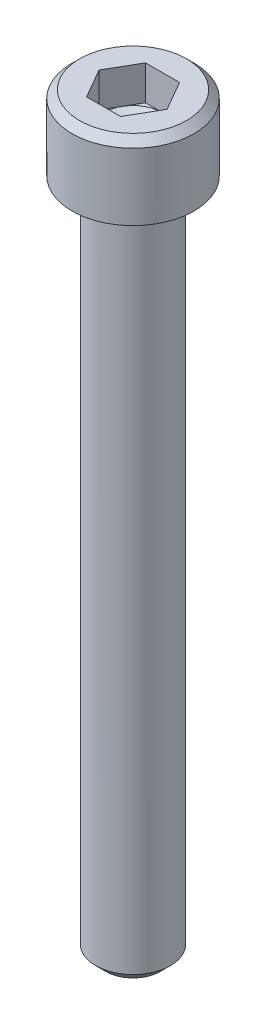
ISO-10303-21;
HEADER;
FILE_DESCRIPTION(('STEP AP214'),'2;1');
FILE_NAME('part.step','',(''),(''),'','','');
FILE_SCHEMA(('AUTOMOTIVE_DESIGN { 1 0 10303 214 1 1 1 1 }'));
ENDSEC;
DATA;
#1=APPLICATION_CONTEXT('core data for automotive mechanical design processes');
#2=APPLICATION_PROTOCOL_DEFINITION('international standard','automotive_design',2000,#1);
#3=PRODUCT_CONTEXT('',#1,'mechanical');
#4=PRODUCT('Part','Part','',(#3));
#5=PRODUCT_RELATED_PRODUCT_CATEGORY('part','',(#4));
#6=PRODUCT_DEFINITION_FORMATION('','',#4);
#7=PRODUCT_DEFINITION_CONTEXT('part definition',#1,'design');
#8=PRODUCT_DEFINITION('design','',#6,#7);
#9=PRODUCT_DEFINITION_SHAPE('','',#8);
#10=(LENGTH_UNIT() NAMED_UNIT(*) SI_UNIT(.MILLI.,.METRE.));
#11=(NAMED_UNIT(*) PLANE_ANGLE_UNIT() SI_UNIT($,.RADIAN.));
#12=(NAMED_UNIT(*) SI_UNIT($,.STERADIAN.) SOLID_ANGLE_UNIT());
#13=UNCERTAINTY_MEASURE_WITH_UNIT(LENGTH_MEASURE(1.E-05),#10,'distance_accuracy_value','');
#14=(GEOMETRIC_REPRESENTATION_CONTEXT(3) GLOBAL_UNCERTAINTY_ASSIGNED_CONTEXT((#13)) GLOBAL_UNIT_ASSIGNED_CONTEXT((#10,
#11,#12)) REPRESENTATION_CONTEXT('',''));
#15=CARTESIAN_POINT('',(0.,0.,0.));
#16=DIRECTION('',(0.,0.,1.));
#17=DIRECTION('',(1.,0.,0.));
#18=AXIS2_PLACEMENT_3D('',#15,#16,#17);
#19=CARTESIAN_POINT('',(0.,1.87959999988152,0.));
#20=DIRECTION('',(0.,1.,0.));
#21=DIRECTION('',(0.,0.,1.));
#22=AXIS2_PLACEMENT_3D('',#19,#20,#21);
#23=CONICAL_SURFACE('',#22,1.38429999981327,1.04719755105418);
#24=CARTESIAN_POINT('',(0.,1.08037402230821,-1.70530256582424E-10));
#25=VERTEX_POINT('',#24);
#26=VERTEX_LOOP('',#25);
#27=FACE_BOUND('',#26,.T.);
#28=CARTESIAN_POINT('',(0.,1.87959999997998,0.));
#29=DIRECTION('',(0.,1.,0.));
#30=DIRECTION('',(0.,0.,1.));
#31=AXIS2_PLACEMENT_3D('',#28,#29,#30);
#32=CIRCLE('',#31,1.3842999999838);
#33=CARTESIAN_POINT('',(-1.19883896645178,1.87959999998999,-0.692149999995953));
#34=VERTEX_POINT('',#33);
#35=CARTESIAN_POINT('',(0.,1.87959999998999,-1.3842999999919));
#36=VERTEX_POINT('',#35);
#37=EDGE_CURVE('E150',#34,#36,#32,.F.);
#38=ORIENTED_EDGE('',*,*,#37,.F.);
#39=CARTESIAN_POINT('',(0.,1.87959999997998,0.));
#40=DIRECTION('',(0.,1.,0.));
#41=DIRECTION('',(0.,0.,1.));
#42=AXIS2_PLACEMENT_3D('',#39,#40,#41);
#43=CIRCLE('',#42,1.3842999999838);
#44=CARTESIAN_POINT('',(-1.19883896645178,1.87959999998999,0.692149999995946));
#45=VERTEX_POINT('',#44);
#46=EDGE_CURVE('E97',#45,#34,#43,.F.);
#47=ORIENTED_EDGE('',*,*,#46,.F.);
#48=CARTESIAN_POINT('',(0.,1.87959999997998,0.));
#49=DIRECTION('',(0.,1.,0.));
#50=DIRECTION('',(0.,0.,1.));
#51=AXIS2_PLACEMENT_3D('',#48,#49,#50);
#52=CIRCLE('',#51,1.3842999999838);
#53=CARTESIAN_POINT('',(0.,1.87959999998999,1.3842999999919));
#54=VERTEX_POINT('',#53);
#55=EDGE_CURVE('E93',#54,#45,#52,.F.);
#56=ORIENTED_EDGE('',*,*,#55,.F.);
#57=CARTESIAN_POINT('',(0.,1.87959999997998,0.));
#58=DIRECTION('',(0.,1.,0.));
#59=DIRECTION('',(0.,0.,1.));
#60=AXIS2_PLACEMENT_3D('',#57,#58,#59);
#61=CIRCLE('',#60,1.3842999999838);
#62=CARTESIAN_POINT('',(1.19883896645178,1.87959999998999,0.692149999995948));
#63=VERTEX_POINT('',#62);
#64=EDGE_CURVE('E91',#63,#54,#61,.F.);
#65=ORIENTED_EDGE('',*,*,#64,.F.);
#66=CARTESIAN_POINT('',(0.,1.87959999997998,0.));
#67=DIRECTION('',(0.,1.,0.));
#68=DIRECTION('',(0.,0.,1.));
#69=AXIS2_PLACEMENT_3D('',#66,#67,#68);
#70=CIRCLE('',#69,1.3842999999838);
#71=CARTESIAN_POINT('',(1.19883896645178,1.87959999998999,-0.692149999995947));
#72=VERTEX_POINT('',#71);
#73=EDGE_CURVE('E21',#72,#63,#70,.F.);
#74=ORIENTED_EDGE('',*,*,#73,.F.);
#75=CARTESIAN_POINT('',(0.,1.87959999997998,0.));
#76=DIRECTION('',(0.,1.,0.));
#77=DIRECTION('',(0.,0.,1.));
#78=AXIS2_PLACEMENT_3D('',#75,#76,#77);
#79=CIRCLE('',#78,1.3842999999838);
#80=EDGE_CURVE('E108',#36,#72,#79,.F.);
#81=ORIENTED_EDGE('',*,*,#80,.F.);
#82=EDGE_LOOP('',(#38,#47,#56,#65,#74,#81));
#83=FACE_BOUND('',#82,.T.);
#84=ADVANCED_FACE('F18',(#27,#83),#23,.F.);
#85=CARTESIAN_POINT('',(0.,1.8796,0.));
#86=DIRECTION('',(0.,1.,0.));
#87=DIRECTION('',(0.,0.,1.));
#88=AXIS2_PLACEMENT_3D('',#85,#86,#87);
#89=PLANE('',#88);
#90=DIRECTION('',(0.500000000000001,0.,-0.866025403784438));
#91=VECTOR('',#90,1.);
#92=CARTESIAN_POINT('',(0.799225977639198,1.8796,1.3843));
#93=LINE('',#92,#91);
#94=CARTESIAN_POINT('',(1.5984519552784,1.8796,0.));
#95=VERTEX_POINT('',#94);
#96=EDGE_CURVE('E103',#63,#95,#93,.T.);
#97=ORIENTED_EDGE('',*,*,#96,.T.);
#98=DIRECTION('',(-0.499999999999999,0.,-0.866025403784439));
#99=VECTOR('',#98,1.);
#100=CARTESIAN_POINT('',(1.5984519552784,1.8796,0.));
#101=LINE('',#100,#99);
#102=EDGE_CURVE('E106',#95,#72,#101,.T.);
#103=ORIENTED_EDGE('',*,*,#102,.T.);
#104=ORIENTED_EDGE('',*,*,#73,.T.);
#105=EDGE_LOOP('',(#97,#103,#104));
#106=FACE_BOUND('',#105,.T.);
#107=ADVANCED_FACE('F101',(#106),#89,.T.);
#108=CARTESIAN_POINT('',(0.,1.8796,0.));
#109=DIRECTION('',(0.,1.,0.));
#110=DIRECTION('',(0.,0.,1.));
#111=AXIS2_PLACEMENT_3D('',#108,#109,#110);
#112=PLANE('',#111);
#113=DIRECTION('',(-0.499999999999999,0.,-0.866025403784439));
#114=VECTOR('',#113,1.);
#115=CARTESIAN_POINT('',(1.5984519552784,1.8796,0.));
#116=LINE('',#115,#114);
#117=CARTESIAN_POINT('',(0.799225977639201,1.8796,-1.3843));
#118=VERTEX_POINT('',#117);
#119=EDGE_CURVE('E117',#72,#118,#116,.T.);
#120=ORIENTED_EDGE('',*,*,#119,.T.);
#121=DIRECTION('',(-1.,0.,0.));
#122=VECTOR('',#121,1.);
#123=CARTESIAN_POINT('',(0.799225977639201,1.8796,-1.3843));
#124=LINE('',#123,#122);
#125=EDGE_CURVE('E157',#118,#36,#124,.T.);
#126=ORIENTED_EDGE('',*,*,#125,.T.);
#127=ORIENTED_EDGE('',*,*,#80,.T.);
#128=EDGE_LOOP('',(#120,#126,#127));
#129=FACE_BOUND('',#128,.T.);
#130=ADVANCED_FACE('F154',(#129),#112,.T.);
#131=CARTESIAN_POINT('',(0.,1.8796,0.));
#132=DIRECTION('',(0.,1.,0.));
#133=DIRECTION('',(0.,0.,1.));
#134=AXIS2_PLACEMENT_3D('',#131,#132,#133);
#135=PLANE('',#134);
#136=DIRECTION('',(-1.,0.,0.));
#137=VECTOR('',#136,1.);
#138=CARTESIAN_POINT('',(0.799225977639201,1.8796,-1.3843));
#139=LINE('',#138,#137);
#140=CARTESIAN_POINT('',(-0.799225977639195,1.8796,-1.3843));
#141=VERTEX_POINT('',#140);
#142=EDGE_CURVE('E162',#36,#141,#139,.T.);
#143=ORIENTED_EDGE('',*,*,#142,.T.);
#144=DIRECTION('',(-0.5,0.,0.866025403784438));
#145=VECTOR('',#144,1.);
#146=CARTESIAN_POINT('',(-0.799225977639195,1.8796,-1.3843));
#147=LINE('',#146,#145);
#148=EDGE_CURVE('E165',#141,#34,#147,.T.);
#149=ORIENTED_EDGE('',*,*,#148,.T.);
#150=ORIENTED_EDGE('',*,*,#37,.T.);
#151=EDGE_LOOP('',(#143,#149,#150));
#152=FACE_BOUND('',#151,.T.);
#153=ADVANCED_FACE('F161',(#152),#135,.T.);
#154=CARTESIAN_POINT('',(0.,1.8796,0.));
#155=DIRECTION('',(0.,1.,0.));
#156=DIRECTION('',(0.,0.,1.));
#157=AXIS2_PLACEMENT_3D('',#154,#155,#156);
#158=PLANE('',#157);
#159=DIRECTION('',(-0.5,0.,0.866025403784438));
#160=VECTOR('',#159,1.);
#161=CARTESIAN_POINT('',(-0.799225977639195,1.8796,-1.3843));
#162=LINE('',#161,#160);
#163=CARTESIAN_POINT('',(-1.5984519552784,1.8796,0.));
#164=VERTEX_POINT('',#163);
#165=EDGE_CURVE('E173',#34,#164,#162,.T.);
#166=ORIENTED_EDGE('',*,*,#165,.T.);
#167=DIRECTION('',(0.5,0.,0.866025403784439));
#168=VECTOR('',#167,1.);
#169=CARTESIAN_POINT('',(-1.5984519552784,1.8796,0.));
#170=LINE('',#169,#168);
#171=EDGE_CURVE('E232',#164,#45,#170,.T.);
#172=ORIENTED_EDGE('',*,*,#171,.T.);
#173=ORIENTED_EDGE('',*,*,#46,.T.);
#174=EDGE_LOOP('',(#166,#172,#173));
#175=FACE_BOUND('',#174,.T.);
#176=ADVANCED_FACE('F337',(#175),#158,.T.);
#177=CARTESIAN_POINT('',(0.,1.8796,0.));
#178=DIRECTION('',(0.,1.,0.));
#179=DIRECTION('',(0.,0.,1.));
#180=AXIS2_PLACEMENT_3D('',#177,#178,#179);
#181=PLANE('',#180);
#182=DIRECTION('',(1.,0.,0.));
#183=VECTOR('',#182,1.);
#184=CARTESIAN_POINT('',(-0.799225977639198,1.8796,1.3843));
#185=LINE('',#184,#183);
#186=CARTESIAN_POINT('',(0.799225977639198,1.8796,1.3843));
#187=VERTEX_POINT('',#186);
#188=EDGE_CURVE('E113',#54,#187,#185,.T.);
#189=ORIENTED_EDGE('',*,*,#188,.T.);
#190=DIRECTION('',(0.500000000000001,0.,-0.866025403784438));
#191=VECTOR('',#190,1.);
#192=CARTESIAN_POINT('',(0.799225977639198,1.8796,1.3843));
#193=LINE('',#192,#191);
#194=EDGE_CURVE('E110',#187,#63,#193,.T.);
#195=ORIENTED_EDGE('',*,*,#194,.T.);
#196=ORIENTED_EDGE('',*,*,#64,.T.);
#197=EDGE_LOOP('',(#189,#195,#196));
#198=FACE_BOUND('',#197,.T.);
#199=ADVANCED_FACE('F111',(#198),#181,.T.);
#200=CARTESIAN_POINT('',(0.,1.8796,0.));
#201=DIRECTION('',(0.,1.,0.));
#202=DIRECTION('',(0.,0.,1.));
#203=AXIS2_PLACEMENT_3D('',#200,#201,#202);
#204=PLANE('',#203);
#205=DIRECTION('',(0.5,0.,0.866025403784439));
#206=VECTOR('',#205,1.);
#207=CARTESIAN_POINT('',(-1.5984519552784,1.8796,0.));
#208=LINE('',#207,#206);
#209=CARTESIAN_POINT('',(-0.799225977639199,1.8796,1.3843));
#210=VERTEX_POINT('',#209);
#211=EDGE_CURVE('E169',#45,#210,#208,.T.);
#212=ORIENTED_EDGE('',*,*,#211,.T.);
#213=DIRECTION('',(1.,0.,0.));
#214=VECTOR('',#213,1.);
#215=CARTESIAN_POINT('',(-0.799225977639198,1.8796,1.3843));
#216=LINE('',#215,#214);
#217=EDGE_CURVE('E133',#210,#54,#216,.T.);
#218=ORIENTED_EDGE('',*,*,#217,.T.);
#219=ORIENTED_EDGE('',*,*,#55,.T.);
#220=EDGE_LOOP('',(#212,#218,#219));
#221=FACE_BOUND('',#220,.T.);
#222=ADVANCED_FACE('F331',(#221),#204,.T.);
#223=CARTESIAN_POINT('',(0.799225977639198,3.5052,1.3843));
#224=DIRECTION('',(0.866025403784438,0.,0.500000000000001));
#225=DIRECTION('',(0.500000000000001,0.,-0.866025403784438));
#226=AXIS2_PLACEMENT_3D('',#223,#224,#225);
#227=PLANE('',#226);
#228=DIRECTION('',(0.,1.,0.));
#229=VECTOR('',#228,1.);
#230=CARTESIAN_POINT('',(0.799225977639198,3.5052,1.3843));
#231=LINE('',#230,#229);
#232=CARTESIAN_POINT('',(0.799225977639198,3.5052,1.3843));
#233=VERTEX_POINT('',#232);
#234=EDGE_CURVE('E240',#187,#233,#231,.T.);
#235=ORIENTED_EDGE('',*,*,#234,.T.);
#236=DIRECTION('',(0.500000000000002,0.,-0.866025403784437));
#237=VECTOR('',#236,1.);
#238=CARTESIAN_POINT('',(0.799225977639198,3.5052,1.3843));
#239=LINE('',#238,#237);
#240=CARTESIAN_POINT('',(1.5984519552784,3.5052,0.));
#241=VERTEX_POINT('',#240);
#242=EDGE_CURVE('E130',#233,#241,#239,.T.);
#243=ORIENTED_EDGE('',*,*,#242,.T.);
#244=DIRECTION('',(0.,1.,0.));
#245=VECTOR('',#244,1.);
#246=CARTESIAN_POINT('',(1.5984519552784,3.5052,0.));
#247=LINE('',#246,#245);
#248=EDGE_CURVE('E121',#241,#95,#247,.F.);
#249=ORIENTED_EDGE('',*,*,#248,.T.);
#250=ORIENTED_EDGE('',*,*,#96,.F.);
#251=ORIENTED_EDGE('',*,*,#194,.F.);
#252=EDGE_LOOP('',(#235,#243,#249,#250,#251));
#253=FACE_BOUND('',#252,.T.);
#254=ADVANCED_FACE('F119',(#253),#227,.F.);
#255=CARTESIAN_POINT('',(1.5984519552784,3.5052,0.));
#256=DIRECTION('',(0.866025403784439,0.,-0.499999999999999));
#257=DIRECTION('',(-0.499999999999999,0.,-0.866025403784439));
#258=AXIS2_PLACEMENT_3D('',#255,#256,#257);
#259=PLANE('',#258);
#260=ORIENTED_EDGE('',*,*,#248,.F.);
#261=DIRECTION('',(-0.5,0.,-0.866025403784439));
#262=VECTOR('',#261,1.);
#263=CARTESIAN_POINT('',(1.5984519552784,3.5052,0.));
#264=LINE('',#263,#262);
#265=CARTESIAN_POINT('',(0.799225977639201,3.5052,-1.3843));
#266=VERTEX_POINT('',#265);
#267=EDGE_CURVE('E132',#241,#266,#264,.T.);
#268=ORIENTED_EDGE('',*,*,#267,.T.);
#269=DIRECTION('',(0.,1.,0.));
#270=VECTOR('',#269,1.);
#271=CARTESIAN_POINT('',(0.799225977639201,3.5052,-1.3843));
#272=LINE('',#271,#270);
#273=EDGE_CURVE('E181',#266,#118,#272,.F.);
#274=ORIENTED_EDGE('',*,*,#273,.T.);
#275=ORIENTED_EDGE('',*,*,#119,.F.);
#276=ORIENTED_EDGE('',*,*,#102,.F.);
#277=EDGE_LOOP('',(#260,#268,#274,#275,#276));
#278=FACE_BOUND('',#277,.T.);
#279=ADVANCED_FACE('F220',(#278),#259,.F.);
#280=CARTESIAN_POINT('',(0.799225977639201,3.5052,-1.3843));
#281=DIRECTION('',(0.,0.,-1.));
#282=DIRECTION('',(-1.,0.,0.));
#283=AXIS2_PLACEMENT_3D('',#280,#281,#282);
#284=PLANE('',#283);
#285=ORIENTED_EDGE('',*,*,#273,.F.);
#286=DIRECTION('',(1.,0.,0.));
#287=VECTOR('',#286,1.);
#288=CARTESIAN_POINT('',(0.,3.5052,-1.3843));
#289=LINE('',#288,#287);
#290=CARTESIAN_POINT('',(-0.799225977639195,3.5052,-1.3843));
#291=VERTEX_POINT('',#290);
#292=EDGE_CURVE('E191',#266,#291,#289,.F.);
#293=ORIENTED_EDGE('',*,*,#292,.T.);
#294=DIRECTION('',(0.,1.,0.));
#295=VECTOR('',#294,1.);
#296=CARTESIAN_POINT('',(-0.799225977639195,3.5052,-1.3843));
#297=LINE('',#296,#295);
#298=EDGE_CURVE('E170',#291,#141,#297,.F.);
#299=ORIENTED_EDGE('',*,*,#298,.T.);
#300=ORIENTED_EDGE('',*,*,#142,.F.);
#301=ORIENTED_EDGE('',*,*,#125,.F.);
#302=EDGE_LOOP('',(#285,#293,#299,#300,#301));
#303=FACE_BOUND('',#302,.T.);
#304=ADVANCED_FACE('F225',(#303),#284,.F.);
#305=CARTESIAN_POINT('',(-0.799225977639195,3.5052,-1.3843));
#306=DIRECTION('',(-0.866025403784438,0.,-0.5));
#307=DIRECTION('',(-0.5,0.,0.866025403784438));
#308=AXIS2_PLACEMENT_3D('',#305,#306,#307);
#309=PLANE('',#308);
#310=ORIENTED_EDGE('',*,*,#298,.F.);
#311=DIRECTION('',(-0.500000000000003,0.,0.866025403784437));
#312=VECTOR('',#311,1.);
#313=CARTESIAN_POINT('',(-0.799225977639195,3.5052,-1.3843));
#314=LINE('',#313,#312);
#315=CARTESIAN_POINT('',(-1.5984519552784,3.5052,0.));
#316=VERTEX_POINT('',#315);
#317=EDGE_CURVE('E189',#291,#316,#314,.T.);
#318=ORIENTED_EDGE('',*,*,#317,.T.);
#319=DIRECTION('',(0.,1.,0.));
#320=VECTOR('',#319,1.);
#321=CARTESIAN_POINT('',(-1.5984519552784,3.5052,0.));
#322=LINE('',#321,#320);
#323=EDGE_CURVE('E175',#316,#164,#322,.F.);
#324=ORIENTED_EDGE('',*,*,#323,.T.);
#325=ORIENTED_EDGE('',*,*,#165,.F.);
#326=ORIENTED_EDGE('',*,*,#148,.F.);
#327=EDGE_LOOP('',(#310,#318,#324,#325,#326));
#328=FACE_BOUND('',#327,.T.);
#329=ADVANCED_FACE('F174',(#328),#309,.F.);
#330=CARTESIAN_POINT('',(-1.5984519552784,3.5052,0.));
#331=DIRECTION('',(-0.866025403784439,0.,0.5));
#332=DIRECTION('',(0.5,0.,0.866025403784439));
#333=AXIS2_PLACEMENT_3D('',#330,#331,#332);
#334=PLANE('',#333);
#335=ORIENTED_EDGE('',*,*,#323,.F.);
#336=DIRECTION('',(0.500000000000001,0.,0.866025403784438));
#337=VECTOR('',#336,1.);
#338=CARTESIAN_POINT('',(-1.5984519552784,3.5052,0.));
#339=LINE('',#338,#337);
#340=CARTESIAN_POINT('',(-0.799225977639198,3.5052,1.3843));
#341=VERTEX_POINT('',#340);
#342=EDGE_CURVE('E36',#316,#341,#339,.T.);
#343=ORIENTED_EDGE('',*,*,#342,.T.);
#344=DIRECTION('',(0.,1.,0.));
#345=VECTOR('',#344,1.);
#346=CARTESIAN_POINT('',(-0.799225977639198,3.5052,1.3843));
#347=LINE('',#346,#345);
#348=EDGE_CURVE('E242',#341,#210,#347,.F.);
#349=ORIENTED_EDGE('',*,*,#348,.T.);
#350=ORIENTED_EDGE('',*,*,#211,.F.);
#351=ORIENTED_EDGE('',*,*,#171,.F.);
#352=EDGE_LOOP('',(#335,#343,#349,#350,#351));
#353=FACE_BOUND('',#352,.T.);
#354=ADVANCED_FACE('F230',(#353),#334,.F.);
#355=CARTESIAN_POINT('',(-0.799225977639198,3.5052,1.3843));
#356=DIRECTION('',(0.,0.,1.));
#357=DIRECTION('',(1.,0.,0.));
#358=AXIS2_PLACEMENT_3D('',#355,#356,#357);
#359=PLANE('',#358);
#360=ORIENTED_EDGE('',*,*,#348,.F.);
#361=DIRECTION('',(1.,0.,0.));
#362=VECTOR('',#361,1.);
#363=CARTESIAN_POINT('',(0.,3.5052,1.3843));
#364=LINE('',#363,#362);
#365=EDGE_CURVE('E146',#341,#233,#364,.T.);
#366=ORIENTED_EDGE('',*,*,#365,.T.);
#367=ORIENTED_EDGE('',*,*,#234,.F.);
#368=ORIENTED_EDGE('',*,*,#188,.F.);
#369=ORIENTED_EDGE('',*,*,#217,.F.);
#370=EDGE_LOOP('',(#360,#366,#367,#368,#369));
#371=FACE_BOUND('',#370,.T.);
#372=ADVANCED_FACE('F317',(#371),#359,.F.);
#373=CARTESIAN_POINT('',(0.,3.5052,0.));
#374=DIRECTION('',(0.,-1.,0.));
#375=DIRECTION('',(0.,0.,-1.));
#376=AXIS2_PLACEMENT_3D('',#373,#374,#375);
#377=PLANE('',#376);
#378=ORIENTED_EDGE('',*,*,#342,.F.);
#379=ORIENTED_EDGE('',*,*,#317,.F.);
#380=ORIENTED_EDGE('',*,*,#292,.F.);
#381=ORIENTED_EDGE('',*,*,#267,.F.);
#382=ORIENTED_EDGE('',*,*,#242,.F.);
#383=ORIENTED_EDGE('',*,*,#365,.F.);
#384=EDGE_LOOP('',(#378,#379,#380,#381,#382,#383));
#385=FACE_BOUND('',#384,.T.);
#386=CARTESIAN_POINT('',(0.,3.50519999989274,0.));
#387=DIRECTION('',(0.,-1.,0.));
#388=DIRECTION('',(1.,0.,0.));
#389=AXIS2_PLACEMENT_3D('',#386,#387,#388);
#390=CIRCLE('',#389,2.51460000004045);
#391=CARTESIAN_POINT('',(2.51460000004045,3.50519999989274,0.));
#392=VERTEX_POINT('',#391);
#393=EDGE_CURVE('E144',#392,#392,#390,.T.);
#394=ORIENTED_EDGE('',*,*,#393,.F.);
#395=EDGE_LOOP('',(#394));
#396=FACE_BOUND('',#395,.T.);
#397=ADVANCED_FACE('F227',(#385,#396),#377,.F.);
#398=CARTESIAN_POINT('',(0.,3.149599999972,0.));
#399=DIRECTION('',(0.,-1.,0.));
#400=DIRECTION('',(1.,0.,0.));
#401=AXIS2_PLACEMENT_3D('',#398,#399,#400);
#402=CONICAL_SURFACE('',#401,2.87020000001803,0.785398163477374);
#403=CARTESIAN_POINT('',(0.,3.1496,0.));
#404=DIRECTION('',(0.,-1.,0.));
#405=DIRECTION('',(0.,0.,-1.));
#406=AXIS2_PLACEMENT_3D('',#403,#404,#405);
#407=CIRCLE('',#406,2.8702);
#408=CARTESIAN_POINT('',(0.,3.1496,-2.8702));
#409=VERTEX_POINT('',#408);
#410=EDGE_CURVE('E143',#409,#409,#407,.T.);
#411=ORIENTED_EDGE('',*,*,#410,.F.);
#412=EDGE_LOOP('',(#411));
#413=FACE_BOUND('',#412,.T.);
#414=ORIENTED_EDGE('',*,*,#393,.T.);
#415=EDGE_LOOP('',(#414));
#416=FACE_BOUND('',#415,.T.);
#417=ADVANCED_FACE('F310',(#413,#416),#402,.T.);
#418=CARTESIAN_POINT('',(0.,5.26796,0.));
#419=DIRECTION('',(0.,-1.,0.));
#420=DIRECTION('',(0.,0.,-1.));
#421=AXIS2_PLACEMENT_3D('',#418,#419,#420);
#422=CYLINDRICAL_SURFACE('',#421,2.8702);
#423=CARTESIAN_POINT('',(0.,0.,0.));
#424=DIRECTION('',(0.,-1.,0.));
#425=DIRECTION('',(0.,0.,-1.));
#426=AXIS2_PLACEMENT_3D('',#423,#424,#425);
#427=CIRCLE('',#426,2.8702);
#428=CARTESIAN_POINT('',(0.,0.,-2.8702));
#429=VERTEX_POINT('',#428);
#430=EDGE_CURVE('E140',#429,#429,#427,.T.);
#431=ORIENTED_EDGE('',*,*,#430,.F.);
#432=EDGE_LOOP('',(#431));
#433=FACE_BOUND('',#432,.T.);
#434=ORIENTED_EDGE('',*,*,#410,.T.);
#435=EDGE_LOOP('',(#434));
#436=FACE_BOUND('',#435,.T.);
#437=ADVANCED_FACE('F307',(#433,#436),#422,.T.);
#438=CARTESIAN_POINT('',(0.,0.,0.));
#439=DIRECTION('',(0.,-1.,0.));
#440=DIRECTION('',(0.,0.,-1.));
#441=AXIS2_PLACEMENT_3D('',#438,#439,#440);
#442=PLANE('',#441);
#443=CARTESIAN_POINT('',(0.,0.,0.));
#444=DIRECTION('',(0.,-1.,0.));
#445=DIRECTION('',(-1.,0.,-2.63360828039282E-11));
#446=AXIS2_PLACEMENT_3D('',#443,#444,#445);
#447=CIRCLE('',#446,2.0066);
#448=CARTESIAN_POINT('',(-2.0066,0.,-5.28459837543624E-11));
#449=VERTEX_POINT('',#448);
#450=EDGE_CURVE('E139',#449,#449,#447,.F.);
#451=ORIENTED_EDGE('',*,*,#450,.T.);
#452=EDGE_LOOP('',(#451));
#453=FACE_BOUND('',#452,.T.);
#454=ORIENTED_EDGE('',*,*,#430,.T.);
#455=EDGE_LOOP('',(#454));
#456=FACE_BOUND('',#455,.T.);
#457=ADVANCED_FACE('F298',(#453,#456),#442,.T.);
#458=CARTESIAN_POINT('',(0.,-31.75,0.));
#459=DIRECTION('',(0.,-1.,0.));
#460=DIRECTION('',(0.,0.,-1.));
#461=AXIS2_PLACEMENT_3D('',#458,#459,#460);
#462=PLANE('',#461);
#463=CARTESIAN_POINT('',(0.,-31.7499999999313,0.));
#464=DIRECTION('',(0.,1.,0.));
#465=DIRECTION('',(0.,0.,1.));
#466=AXIS2_PLACEMENT_3D('',#463,#464,#465);
#467=CIRCLE('',#466,1.28015999996478);
#468=CARTESIAN_POINT('',(0.,-31.7499999999313,1.28015999996478));
#469=VERTEX_POINT('',#468);
#470=EDGE_CURVE('E136',#469,#469,#467,.T.);
#471=ORIENTED_EDGE('',*,*,#470,.F.);
#472=EDGE_LOOP('',(#471));
#473=FACE_BOUND('',#472,.T.);
#474=ADVANCED_FACE('F285',(#473),#462,.T.);
#475=CARTESIAN_POINT('',(0.,-0.254,0.));
#476=DIRECTION('',(0.,-1.,0.));
#477=DIRECTION('',(0.,0.,-1.));
#478=AXIS2_PLACEMENT_3D('',#475,#476,#477);
#479=TOROIDAL_SURFACE('',#478,2.0066,0.254);
#480=CARTESIAN_POINT('',(0.,-0.254,0.));
#481=DIRECTION('',(0.,-1.,0.));
#482=DIRECTION('',(0.,0.,-1.));
#483=AXIS2_PLACEMENT_3D('',#480,#481,#482);
#484=CIRCLE('',#483,1.7526);
#485=CARTESIAN_POINT('',(0.,-0.254,-1.7526));
#486=VERTEX_POINT('',#485);
#487=EDGE_CURVE('E27',#486,#486,#484,.T.);
#488=ORIENTED_EDGE('',*,*,#487,.F.);
#489=EDGE_LOOP('',(#488));
#490=FACE_BOUND('',#489,.T.);
#491=ORIENTED_EDGE('',*,*,#450,.F.);
#492=EDGE_LOOP('',(#491));
#493=FACE_BOUND('',#492,.T.);
#494=ADVANCED_FACE('F273',(#490,#493),#479,.F.);
#495=CARTESIAN_POINT('',(0.,-31.2775599999782,0.));
#496=DIRECTION('',(0.,1.,0.));
#497=DIRECTION('',(0.,0.,1.));
#498=AXIS2_PLACEMENT_3D('',#495,#496,#497);
#499=CONICAL_SURFACE('',#498,1.75259999991795,0.785398163397448);
#500=ORIENTED_EDGE('',*,*,#470,.T.);
#501=EDGE_LOOP('',(#500));
#502=FACE_BOUND('',#501,.T.);
#503=CARTESIAN_POINT('',(0.,-31.27756,0.));
#504=DIRECTION('',(0.,-1.,0.));
#505=DIRECTION('',(0.,0.,-1.));
#506=AXIS2_PLACEMENT_3D('',#503,#504,#505);
#507=CIRCLE('',#506,1.7526);
#508=CARTESIAN_POINT('',(0.,-31.27756,-1.7526));
#509=VERTEX_POINT('',#508);
#510=EDGE_CURVE('E11',#509,#509,#507,.F.);
#511=ORIENTED_EDGE('',*,*,#510,.F.);
#512=EDGE_LOOP('',(#511));
#513=FACE_BOUND('',#512,.T.);
#514=ADVANCED_FACE('F284',(#502,#513),#499,.T.);
#515=CARTESIAN_POINT('',(0.,5.26796,0.));
#516=DIRECTION('',(0.,-1.,0.));
#517=DIRECTION('',(0.,0.,-1.));
#518=AXIS2_PLACEMENT_3D('',#515,#516,#517);
#519=CYLINDRICAL_SURFACE('',#518,1.7526);
#520=ORIENTED_EDGE('',*,*,#510,.T.);
#521=EDGE_LOOP('',(#520));
#522=FACE_BOUND('',#521,.T.);
#523=ORIENTED_EDGE('',*,*,#487,.T.);
#524=EDGE_LOOP('',(#523));
#525=FACE_BOUND('',#524,.T.);
#526=ADVANCED_FACE('F349',(#522,#525),#519,.T.);
#527=CLOSED_SHELL('',(#84,#107,#130,#153,#176,#199,#222,#254,#279,#304,#329,#354,#372,#397,#417,
#437,#457,#474,#494,#514,#526));
#528=MANIFOLD_SOLID_BREP('B1',#527);
#529=ADVANCED_BREP_SHAPE_REPRESENTATION('',(#18,#528),#14);
#530=SHAPE_DEFINITION_REPRESENTATION(#9,#529);
ENDSEC;
END-ISO-10303-21;
